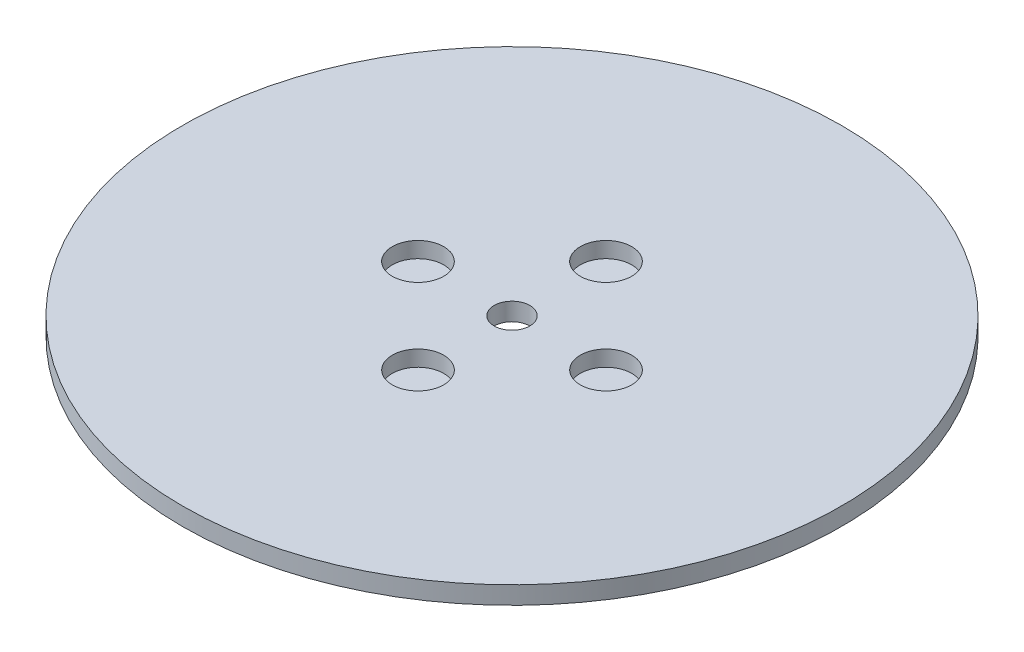
ISO-10303-21;
HEADER;
FILE_DESCRIPTION(('STEP AP214'),'2;1');
FILE_NAME('part.step','',(''),(''),'','','');
FILE_SCHEMA(('AUTOMOTIVE_DESIGN { 1 0 10303 214 1 1 1 1 }'));
ENDSEC;
DATA;
#1=APPLICATION_CONTEXT('core data for automotive mechanical design processes');
#2=APPLICATION_PROTOCOL_DEFINITION('international standard','automotive_design',2000,#1);
#3=PRODUCT_CONTEXT('',#1,'mechanical');
#4=PRODUCT('Part','Part','',(#3));
#5=PRODUCT_RELATED_PRODUCT_CATEGORY('part','',(#4));
#6=PRODUCT_DEFINITION_FORMATION('','',#4);
#7=PRODUCT_DEFINITION_CONTEXT('part definition',#1,'design');
#8=PRODUCT_DEFINITION('design','',#6,#7);
#9=PRODUCT_DEFINITION_SHAPE('','',#8);
#10=(LENGTH_UNIT() NAMED_UNIT(*) SI_UNIT(.MILLI.,.METRE.));
#11=(NAMED_UNIT(*) PLANE_ANGLE_UNIT() SI_UNIT($,.RADIAN.));
#12=(NAMED_UNIT(*) SI_UNIT($,.STERADIAN.) SOLID_ANGLE_UNIT());
#13=UNCERTAINTY_MEASURE_WITH_UNIT(LENGTH_MEASURE(1.E-05),#10,'distance_accuracy_value','');
#14=(GEOMETRIC_REPRESENTATION_CONTEXT(3) GLOBAL_UNCERTAINTY_ASSIGNED_CONTEXT((#13)) GLOBAL_UNIT_ASSIGNED_CONTEXT((#10,
#11,#12)) REPRESENTATION_CONTEXT('',''));
#15=CARTESIAN_POINT('',(0.,0.,0.));
#16=DIRECTION('',(0.,0.,1.));
#17=DIRECTION('',(1.,0.,0.));
#18=AXIS2_PLACEMENT_3D('',#15,#16,#17);
#19=CARTESIAN_POINT('',(0.,5.,0.));
#20=DIRECTION('',(0.,-1.,0.));
#21=DIRECTION('',(0.,0.,-1.));
#22=AXIS2_PLACEMENT_3D('',#19,#20,#21);
#23=CYLINDRICAL_SURFACE('',#22,92.5);
#24=CARTESIAN_POINT('',(0.,5.,0.));
#25=DIRECTION('',(0.,1.,0.));
#26=DIRECTION('',(0.,0.,1.));
#27=AXIS2_PLACEMENT_3D('',#24,#25,#26);
#28=CIRCLE('',#27,92.5);
#29=CARTESIAN_POINT('',(0.,5.,92.5));
#30=VERTEX_POINT('',#29);
#31=EDGE_CURVE('E10',#30,#30,#28,.T.);
#32=ORIENTED_EDGE('',*,*,#31,.F.);
#33=EDGE_LOOP('',(#32));
#34=FACE_BOUND('',#33,.T.);
#35=CARTESIAN_POINT('',(0.,0.,0.));
#36=DIRECTION('',(0.,1.,0.));
#37=DIRECTION('',(0.,0.,1.));
#38=AXIS2_PLACEMENT_3D('',#35,#36,#37);
#39=CIRCLE('',#38,92.5);
#40=CARTESIAN_POINT('',(0.,0.,92.5));
#41=VERTEX_POINT('',#40);
#42=EDGE_CURVE('E37',#41,#41,#39,.T.);
#43=ORIENTED_EDGE('',*,*,#42,.T.);
#44=EDGE_LOOP('',(#43));
#45=FACE_BOUND('',#44,.T.);
#46=ADVANCED_FACE('F40',(#34,#45),#23,.T.);
#47=CARTESIAN_POINT('',(0.,5.,0.));
#48=DIRECTION('',(0.,1.,0.));
#49=DIRECTION('',(0.,0.,1.));
#50=AXIS2_PLACEMENT_3D('',#47,#48,#49);
#51=PLANE('',#50);
#52=CARTESIAN_POINT('',(0.,5.,26.3853908285046));
#53=DIRECTION('',(0.,1.,0.));
#54=DIRECTION('',(1.,0.,0.));
#55=AXIS2_PLACEMENT_3D('',#52,#53,#54);
#56=CIRCLE('',#55,7.21889140619523);
#57=CARTESIAN_POINT('',(7.21889140619532,5.,26.3853908285046));
#58=VERTEX_POINT('',#57);
#59=EDGE_CURVE('E71',#58,#58,#56,.T.);
#60=ORIENTED_EDGE('',*,*,#59,.F.);
#61=EDGE_LOOP('',(#60));
#62=FACE_BOUND('',#61,.T.);
#63=CARTESIAN_POINT('',(26.3853908285046,5.,0.));
#64=DIRECTION('',(0.,1.,0.));
#65=DIRECTION('',(0.,0.,-1.));
#66=AXIS2_PLACEMENT_3D('',#63,#64,#65);
#67=CIRCLE('',#66,7.21889140619523);
#68=CARTESIAN_POINT('',(26.3853908285046,5.,-7.21889140619523));
#69=VERTEX_POINT('',#68);
#70=EDGE_CURVE('E70',#69,#69,#67,.T.);
#71=ORIENTED_EDGE('',*,*,#70,.F.);
#72=EDGE_LOOP('',(#71));
#73=FACE_BOUND('',#72,.T.);
#74=CARTESIAN_POINT('',(-2.7637229908742E-13,5.,-26.3853908285046));
#75=DIRECTION('',(0.,1.,0.));
#76=DIRECTION('',(-1.,0.,0.));
#77=AXIS2_PLACEMENT_3D('',#74,#75,#76);
#78=CIRCLE('',#77,7.21889140619523);
#79=CARTESIAN_POINT('',(-7.21889140619551,5.,-26.3853908285046));
#80=VERTEX_POINT('',#79);
#81=EDGE_CURVE('E61',#80,#80,#78,.T.);
#82=ORIENTED_EDGE('',*,*,#81,.F.);
#83=EDGE_LOOP('',(#82));
#84=FACE_BOUND('',#83,.T.);
#85=CARTESIAN_POINT('',(-26.3853908285046,5.,0.));
#86=DIRECTION('',(0.,1.,0.));
#87=DIRECTION('',(0.,0.,1.));
#88=AXIS2_PLACEMENT_3D('',#85,#86,#87);
#89=CIRCLE('',#88,7.21889140619523);
#90=CARTESIAN_POINT('',(-26.3853908285046,5.,7.21889140619523));
#91=VERTEX_POINT('',#90);
#92=EDGE_CURVE('E54',#91,#91,#89,.T.);
#93=ORIENTED_EDGE('',*,*,#92,.F.);
#94=EDGE_LOOP('',(#93));
#95=FACE_BOUND('',#94,.T.);
#96=CARTESIAN_POINT('',(0.,5.,0.));
#97=DIRECTION('',(0.,1.,0.));
#98=DIRECTION('',(0.,0.,1.));
#99=AXIS2_PLACEMENT_3D('',#96,#97,#98);
#100=CIRCLE('',#99,5.);
#101=CARTESIAN_POINT('',(0.,5.,5.));
#102=VERTEX_POINT('',#101);
#103=EDGE_CURVE('E50',#102,#102,#100,.T.);
#104=ORIENTED_EDGE('',*,*,#103,.F.);
#105=EDGE_LOOP('',(#104));
#106=FACE_BOUND('',#105,.T.);
#107=ORIENTED_EDGE('',*,*,#31,.T.);
#108=EDGE_LOOP('',(#107));
#109=FACE_BOUND('',#108,.T.);
#110=ADVANCED_FACE('F86',(#62,#73,#84,#95,#106,#109),#51,.T.);
#111=CARTESIAN_POINT('',(0.,0.,0.));
#112=DIRECTION('',(0.,1.,0.));
#113=DIRECTION('',(0.,0.,1.));
#114=AXIS2_PLACEMENT_3D('',#111,#112,#113);
#115=PLANE('',#114);
#116=CARTESIAN_POINT('',(0.,0.,0.));
#117=DIRECTION('',(0.,1.,0.));
#118=DIRECTION('',(0.,0.,1.));
#119=AXIS2_PLACEMENT_3D('',#116,#117,#118);
#120=CIRCLE('',#119,5.);
#121=CARTESIAN_POINT('',(0.,0.,5.));
#122=VERTEX_POINT('',#121);
#123=EDGE_CURVE('E47',#122,#122,#120,.T.);
#124=ORIENTED_EDGE('',*,*,#123,.T.);
#125=EDGE_LOOP('',(#124));
#126=FACE_BOUND('',#125,.T.);
#127=ORIENTED_EDGE('',*,*,#42,.F.);
#128=EDGE_LOOP('',(#127));
#129=FACE_BOUND('',#128,.T.);
#130=ADVANCED_FACE('F93',(#126,#129),#115,.F.);
#131=CARTESIAN_POINT('',(0.,5.,0.));
#132=DIRECTION('',(0.,-1.,0.));
#133=DIRECTION('',(0.,0.,-1.));
#134=AXIS2_PLACEMENT_3D('',#131,#132,#133);
#135=CYLINDRICAL_SURFACE('',#134,5.);
#136=ORIENTED_EDGE('',*,*,#103,.T.);
#137=EDGE_LOOP('',(#136));
#138=FACE_BOUND('',#137,.T.);
#139=ORIENTED_EDGE('',*,*,#123,.F.);
#140=EDGE_LOOP('',(#139));
#141=FACE_BOUND('',#140,.T.);
#142=ADVANCED_FACE('F101',(#138,#141),#135,.F.);
#143=CARTESIAN_POINT('',(-26.3853908285046,0.56446438716449,0.));
#144=DIRECTION('',(0.,1.,0.));
#145=DIRECTION('',(0.,0.,1.));
#146=AXIS2_PLACEMENT_3D('',#143,#144,#145);
#147=CYLINDRICAL_SURFACE('',#146,7.21889140619523);
#148=CARTESIAN_POINT('',(-26.3853908285046,0.56446438716449,0.));
#149=DIRECTION('',(0.,1.,0.));
#150=DIRECTION('',(0.,0.,1.));
#151=AXIS2_PLACEMENT_3D('',#148,#149,#150);
#152=CIRCLE('',#151,7.21889140619523);
#153=CARTESIAN_POINT('',(-26.3853908285046,0.56446438716449,7.21889140619523));
#154=VERTEX_POINT('',#153);
#155=EDGE_CURVE('E55',#154,#154,#152,.T.);
#156=ORIENTED_EDGE('',*,*,#155,.F.);
#157=EDGE_LOOP('',(#156));
#158=FACE_BOUND('',#157,.T.);
#159=ORIENTED_EDGE('',*,*,#92,.T.);
#160=EDGE_LOOP('',(#159));
#161=FACE_BOUND('',#160,.T.);
#162=ADVANCED_FACE('F102',(#158,#161),#147,.F.);
#163=CARTESIAN_POINT('',(-26.3853908285046,0.56446438716449,0.));
#164=DIRECTION('',(0.,1.,0.));
#165=DIRECTION('',(0.,0.,1.));
#166=AXIS2_PLACEMENT_3D('',#163,#164,#165);
#167=PLANE('',#166);
#168=ORIENTED_EDGE('',*,*,#155,.T.);
#169=EDGE_LOOP('',(#168));
#170=FACE_BOUND('',#169,.T.);
#171=ADVANCED_FACE('F133',(#170),#167,.T.);
#172=CARTESIAN_POINT('',(-2.7637229908742E-13,0.56446438716449,-26.3853908285046));
#173=DIRECTION('',(0.,1.,0.));
#174=DIRECTION('',(0.,0.,1.));
#175=AXIS2_PLACEMENT_3D('',#172,#173,#174);
#176=CYLINDRICAL_SURFACE('',#175,7.21889140619523);
#177=CARTESIAN_POINT('',(-2.7637229908742E-13,0.56446438716449,-26.3853908285046));
#178=DIRECTION('',(0.,1.,0.));
#179=DIRECTION('',(-1.,0.,0.));
#180=AXIS2_PLACEMENT_3D('',#177,#178,#179);
#181=CIRCLE('',#180,7.21889140619523);
#182=CARTESIAN_POINT('',(-7.21889140619551,0.56446438716449,-26.3853908285046));
#183=VERTEX_POINT('',#182);
#184=EDGE_CURVE('E63',#183,#183,#181,.T.);
#185=ORIENTED_EDGE('',*,*,#184,.F.);
#186=EDGE_LOOP('',(#185));
#187=FACE_BOUND('',#186,.T.);
#188=ORIENTED_EDGE('',*,*,#81,.T.);
#189=EDGE_LOOP('',(#188));
#190=FACE_BOUND('',#189,.T.);
#191=ADVANCED_FACE('F142',(#187,#190),#176,.F.);
#192=CARTESIAN_POINT('',(-2.7637229908742E-13,0.56446438716449,-26.3853908285046));
#193=DIRECTION('',(0.,1.,0.));
#194=DIRECTION('',(-1.,0.,0.));
#195=AXIS2_PLACEMENT_3D('',#192,#193,#194);
#196=PLANE('',#195);
#197=ORIENTED_EDGE('',*,*,#184,.T.);
#198=EDGE_LOOP('',(#197));
#199=FACE_BOUND('',#198,.T.);
#200=ADVANCED_FACE('F156',(#199),#196,.T.);
#201=CARTESIAN_POINT('',(26.3853908285046,0.56446438716449,0.));
#202=DIRECTION('',(0.,1.,0.));
#203=DIRECTION('',(0.,0.,1.));
#204=AXIS2_PLACEMENT_3D('',#201,#202,#203);
#205=CYLINDRICAL_SURFACE('',#204,7.21889140619523);
#206=CARTESIAN_POINT('',(26.3853908285046,0.56446438716449,0.));
#207=DIRECTION('',(0.,1.,0.));
#208=DIRECTION('',(0.,0.,-1.));
#209=AXIS2_PLACEMENT_3D('',#206,#207,#208);
#210=CIRCLE('',#209,7.21889140619523);
#211=CARTESIAN_POINT('',(26.3853908285046,0.56446438716449,-7.21889140619523));
#212=VERTEX_POINT('',#211);
#213=EDGE_CURVE('E69',#212,#212,#210,.T.);
#214=ORIENTED_EDGE('',*,*,#213,.F.);
#215=EDGE_LOOP('',(#214));
#216=FACE_BOUND('',#215,.T.);
#217=ORIENTED_EDGE('',*,*,#70,.T.);
#218=EDGE_LOOP('',(#217));
#219=FACE_BOUND('',#218,.T.);
#220=ADVANCED_FACE('F164',(#216,#219),#205,.F.);
#221=CARTESIAN_POINT('',(26.3853908285046,0.56446438716449,0.));
#222=DIRECTION('',(0.,1.,0.));
#223=DIRECTION('',(0.,0.,-1.));
#224=AXIS2_PLACEMENT_3D('',#221,#222,#223);
#225=PLANE('',#224);
#226=ORIENTED_EDGE('',*,*,#213,.T.);
#227=EDGE_LOOP('',(#226));
#228=FACE_BOUND('',#227,.T.);
#229=ADVANCED_FACE('F83',(#228),#225,.T.);
#230=CARTESIAN_POINT('',(0.,0.56446438716449,26.3853908285046));
#231=DIRECTION('',(0.,1.,0.));
#232=DIRECTION('',(0.,0.,1.));
#233=AXIS2_PLACEMENT_3D('',#230,#231,#232);
#234=CYLINDRICAL_SURFACE('',#233,7.21889140619523);
#235=CARTESIAN_POINT('',(0.,0.56446438716449,26.3853908285046));
#236=DIRECTION('',(0.,1.,0.));
#237=DIRECTION('',(1.,0.,0.));
#238=AXIS2_PLACEMENT_3D('',#235,#236,#237);
#239=CIRCLE('',#238,7.21889140619523);
#240=CARTESIAN_POINT('',(7.21889140619532,0.56446438716449,26.3853908285046));
#241=VERTEX_POINT('',#240);
#242=EDGE_CURVE('E59',#241,#241,#239,.T.);
#243=ORIENTED_EDGE('',*,*,#242,.F.);
#244=EDGE_LOOP('',(#243));
#245=FACE_BOUND('',#244,.T.);
#246=ORIENTED_EDGE('',*,*,#59,.T.);
#247=EDGE_LOOP('',(#246));
#248=FACE_BOUND('',#247,.T.);
#249=ADVANCED_FACE('F81',(#245,#248),#234,.F.);
#250=CARTESIAN_POINT('',(0.,0.56446438716449,26.3853908285046));
#251=DIRECTION('',(0.,1.,0.));
#252=DIRECTION('',(1.,0.,0.));
#253=AXIS2_PLACEMENT_3D('',#250,#251,#252);
#254=PLANE('',#253);
#255=ORIENTED_EDGE('',*,*,#242,.T.);
#256=EDGE_LOOP('',(#255));
#257=FACE_BOUND('',#256,.T.);
#258=ADVANCED_FACE('F78',(#257),#254,.T.);
#259=CLOSED_SHELL('',(#46,#110,#130,#142,#162,#171,#191,#200,#220,#229,#249,#258));
#260=MANIFOLD_SOLID_BREP('B2',#259);
#261=ADVANCED_BREP_SHAPE_REPRESENTATION('',(#18,#260),#14);
#262=SHAPE_DEFINITION_REPRESENTATION(#9,#261);
ENDSEC;
END-ISO-10303-21;
